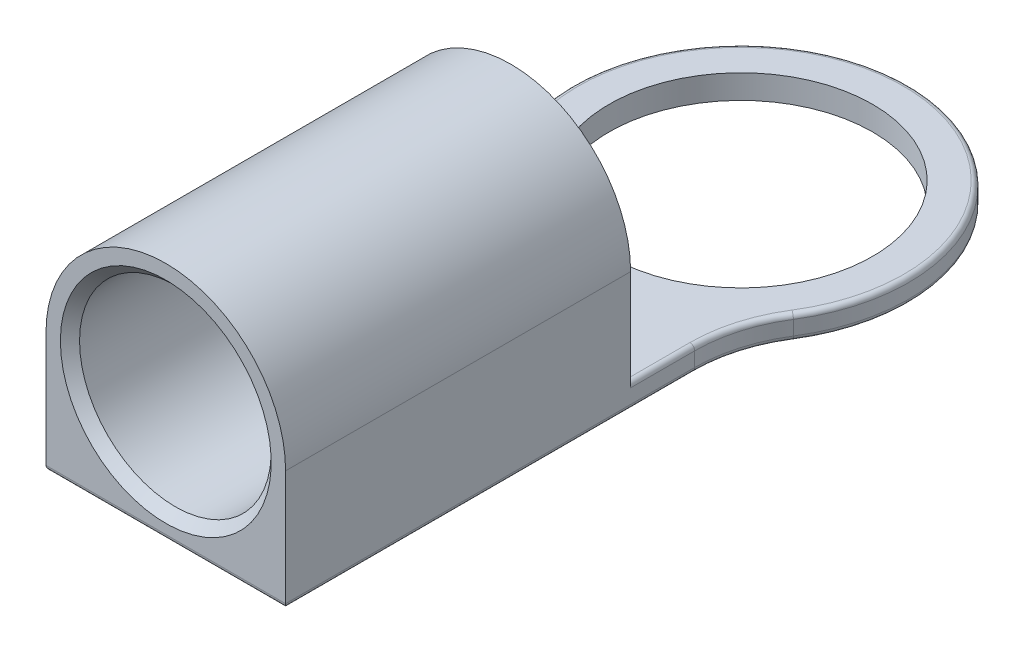
ISO-10303-21;
HEADER;
FILE_DESCRIPTION(('STEP AP214'),'2;1');
FILE_NAME('part.step','',(''),(''),'','','');
FILE_SCHEMA(('AUTOMOTIVE_DESIGN { 1 0 10303 214 1 1 1 1 }'));
ENDSEC;
DATA;
#1=APPLICATION_CONTEXT('core data for automotive mechanical design processes');
#2=APPLICATION_PROTOCOL_DEFINITION('international standard','automotive_design',2000,#1);
#3=PRODUCT_CONTEXT('',#1,'mechanical');
#4=PRODUCT('Part','Part','',(#3));
#5=PRODUCT_RELATED_PRODUCT_CATEGORY('part','',(#4));
#6=PRODUCT_DEFINITION_FORMATION('','',#4);
#7=PRODUCT_DEFINITION_CONTEXT('part definition',#1,'design');
#8=PRODUCT_DEFINITION('design','',#6,#7);
#9=PRODUCT_DEFINITION_SHAPE('','',#8);
#10=(LENGTH_UNIT() NAMED_UNIT(*) SI_UNIT(.MILLI.,.METRE.));
#11=(NAMED_UNIT(*) PLANE_ANGLE_UNIT() SI_UNIT($,.RADIAN.));
#12=(NAMED_UNIT(*) SI_UNIT($,.STERADIAN.) SOLID_ANGLE_UNIT());
#13=UNCERTAINTY_MEASURE_WITH_UNIT(LENGTH_MEASURE(1.E-05),#10,'distance_accuracy_value','');
#14=(GEOMETRIC_REPRESENTATION_CONTEXT(3) GLOBAL_UNCERTAINTY_ASSIGNED_CONTEXT((#13)) GLOBAL_UNIT_ASSIGNED_CONTEXT((#10,
#11,#12)) REPRESENTATION_CONTEXT('',''));
#15=CARTESIAN_POINT('',(0.,0.,0.));
#16=DIRECTION('',(0.,0.,1.));
#17=DIRECTION('',(1.,0.,0.));
#18=AXIS2_PLACEMENT_3D('',#15,#16,#17);
#19=CARTESIAN_POINT('',(0.,2.5,4.8));
#20=DIRECTION('',(0.,0.,1.));
#21=DIRECTION('',(1.,0.,0.));
#22=AXIS2_PLACEMENT_3D('',#19,#20,#21);
#23=CYLINDRICAL_SURFACE('',#22,2.5);
#24=DIRECTION('',(0.,0.,-1.));
#25=VECTOR('',#24,1.);
#26=CARTESIAN_POINT('',(2.5,2.5,4.8));
#27=LINE('',#26,#25);
#28=CARTESIAN_POINT('',(2.5,2.5,4.8));
#29=VERTEX_POINT('',#28);
#30=CARTESIAN_POINT('',(2.5,2.5,12.));
#31=VERTEX_POINT('',#30);
#32=EDGE_CURVE('E164',#29,#31,#27,.F.);
#33=ORIENTED_EDGE('',*,*,#32,.F.);
#34=CARTESIAN_POINT('',(0.,2.5,4.8));
#35=DIRECTION('',(0.,0.,-1.));
#36=DIRECTION('',(-1.,0.,0.));
#37=AXIS2_PLACEMENT_3D('',#34,#35,#36);
#38=CIRCLE('',#37,2.5);
#39=CARTESIAN_POINT('',(-2.5,2.5,4.8));
#40=VERTEX_POINT('',#39);
#41=EDGE_CURVE('E147',#40,#29,#38,.T.);
#42=ORIENTED_EDGE('',*,*,#41,.F.);
#43=DIRECTION('',(0.,0.,-1.));
#44=VECTOR('',#43,1.);
#45=CARTESIAN_POINT('',(-2.5,2.5,4.8));
#46=LINE('',#45,#44);
#47=CARTESIAN_POINT('',(-2.5,2.5,12.));
#48=VERTEX_POINT('',#47);
#49=EDGE_CURVE('E161',#48,#40,#46,.T.);
#50=ORIENTED_EDGE('',*,*,#49,.F.);
#51=CARTESIAN_POINT('',(0.,2.5,12.));
#52=DIRECTION('',(0.,0.,-1.));
#53=DIRECTION('',(-1.,0.,0.));
#54=AXIS2_PLACEMENT_3D('',#51,#52,#53);
#55=CIRCLE('',#54,2.5);
#56=EDGE_CURVE('E160',#31,#48,#55,.F.);
#57=ORIENTED_EDGE('',*,*,#56,.F.);
#58=EDGE_LOOP('',(#33,#42,#50,#57));
#59=FACE_BOUND('',#58,.T.);
#60=ADVANCED_FACE('F35',(#59),#23,.T.);
#61=CARTESIAN_POINT('',(5.5,0.5,3.46410161513775));
#62=DIRECTION('',(0.,-1.,0.));
#63=DIRECTION('',(0.,0.,-1.));
#64=AXIS2_PLACEMENT_3D('',#61,#62,#63);
#65=PLANE('',#64);
#66=CARTESIAN_POINT('',(0.,0.5,0.));
#67=DIRECTION('',(0.,1.,0.));
#68=DIRECTION('',(0.,0.,1.));
#69=AXIS2_PLACEMENT_3D('',#66,#67,#68);
#70=CIRCLE('',#69,2.75);
#71=CARTESIAN_POINT('',(0.,0.5,2.75));
#72=VERTEX_POINT('',#71);
#73=EDGE_CURVE('E183',#72,#72,#70,.T.);
#74=ORIENTED_EDGE('',*,*,#73,.F.);
#75=EDGE_LOOP('',(#74));
#76=FACE_BOUND('',#75,.T.);
#77=CARTESIAN_POINT('',(-5.5,0.5,3.46410161513775));
#78=DIRECTION('',(0.,-1.,0.));
#79=DIRECTION('',(0.,0.,-1.));
#80=AXIS2_PLACEMENT_3D('',#77,#78,#79);
#81=CIRCLE('',#80,3.1);
#82=CARTESIAN_POINT('',(-2.87692307692308,0.5,1.81199161407206));
#83=VERTEX_POINT('',#82);
#84=CARTESIAN_POINT('',(-2.4,0.5,3.46410161513775));
#85=VERTEX_POINT('',#84);
#86=EDGE_CURVE('E212',#83,#85,#81,.T.);
#87=ORIENTED_EDGE('',*,*,#86,.T.);
#88=DIRECTION('',(0.,0.,1.));
#89=VECTOR('',#88,1.);
#90=CARTESIAN_POINT('',(-2.4,0.5,3.46410161513775));
#91=LINE('',#90,#89);
#92=CARTESIAN_POINT('',(-2.4,0.5,4.8));
#93=VERTEX_POINT('',#92);
#94=EDGE_CURVE('E214',#85,#93,#91,.T.);
#95=ORIENTED_EDGE('',*,*,#94,.T.);
#96=DIRECTION('',(1.,0.,0.));
#97=VECTOR('',#96,1.);
#98=CARTESIAN_POINT('',(5.5,0.5,4.8));
#99=LINE('',#98,#97);
#100=CARTESIAN_POINT('',(-0.916515138991179,0.5,4.8));
#101=VERTEX_POINT('',#100);
#102=EDGE_CURVE('E177',#93,#101,#99,.T.);
#103=ORIENTED_EDGE('',*,*,#102,.T.);
#104=CARTESIAN_POINT('',(-0.916515138991179,0.5,4.8));
#105=CARTESIAN_POINT('',(-0.84363513674587,0.5,4.83036711002692));
#106=CARTESIAN_POINT('',(-0.769591679324545,0.5,4.85821712422148));
#107=CARTESIAN_POINT('',(-0.62015560894063,0.5,4.90723485742414));
#108=CARTESIAN_POINT('',(-0.544783603633955,0.5,4.92846598854385));
#109=CARTESIAN_POINT('',(-0.392089728971961,0.5,4.96328235288157));
#110=CARTESIAN_POINT('',(-0.314764837301681,0.5,4.97685486610883));
#111=CARTESIAN_POINT('',(-0.197637077381381,0.5,4.99063916830098));
#112=CARTESIAN_POINT('',(-0.158202916956448,0.5,4.9941389191681));
#113=CARTESIAN_POINT('',(-0.0791826842964666,0.5,4.99882328225748));
#114=CARTESIAN_POINT('',(-0.0395965595447545,0.5,5.00000700500127));
#115=CARTESIAN_POINT('',(0.,0.5,5.));
#116=B_SPLINE_CURVE_WITH_KNOTS('',3,(#104,#105,#106,#107,#108,#109,#110,#111,#112,#113,#114,
#115),.UNSPECIFIED.,.F.,.F.,(4,2,2,2,2,4),(0.,0.236967493249268,0.471589511972893,
0.706600069652834,0.825307034604659,0.944059580428228),.UNSPECIFIED.);
#117=CARTESIAN_POINT('',(0.,0.5,5.));
#118=VERTEX_POINT('',#117);
#119=EDGE_CURVE('E11',#101,#118,#116,.T.);
#120=ORIENTED_EDGE('',*,*,#119,.T.);
#121=CARTESIAN_POINT('',(0.,0.5,5.));
#122=CARTESIAN_POINT('',(0.0613789873451756,0.5,5.00005123546817));
#123=CARTESIAN_POINT('',(0.122727231656672,0.5,4.99717564912901));
#124=CARTESIAN_POINT('',(0.244833267973362,0.5,4.98597228224745));
#125=CARTESIAN_POINT('',(0.305591827191289,0.5,4.97765295134158));
#126=CARTESIAN_POINT('',(0.425380928852015,0.5,4.95610541092143));
#127=CARTESIAN_POINT('',(0.484423705308852,0.5,4.94294391419883));
#128=CARTESIAN_POINT('',(0.601374127472574,0.5,4.91230555854885));
#129=CARTESIAN_POINT('',(0.659281667887905,0.5,4.89482830136551));
#130=CARTESIAN_POINT('',(0.750251888680749,0.5,4.86414653727353));
#131=CARTESIAN_POINT('',(0.783728772482835,0.5,4.85214495966499));
#132=CARTESIAN_POINT('',(0.850382498469053,0.5,4.82693851225511));
#133=CARTESIAN_POINT('',(0.883557571552356,0.5,4.81372895663342));
#134=CARTESIAN_POINT('',(0.916515138991186,0.5,4.80000000000002));
#135=B_SPLINE_CURVE_WITH_KNOTS('',3,(#121,#122,#123,#124,#125,#126,#127,#128,#129,#130,#131,
#132,#133,#134),.UNSPECIFIED.,.F.,.F.,(4,2,2,2,2,2,4),(0.,0.18402076479273,0.367756572804944,
0.549050374316312,0.730360911774295,0.837031638223998,0.944135282226703),.UNSPECIFIED.);
#136=CARTESIAN_POINT('',(0.91651513899118,0.5,4.8));
#137=VERTEX_POINT('',#136);
#138=EDGE_CURVE('E48',#118,#137,#135,.T.);
#139=ORIENTED_EDGE('',*,*,#138,.T.);
#140=CARTESIAN_POINT('',(2.4,0.5,4.8));
#141=VERTEX_POINT('',#140);
#142=EDGE_CURVE('E175',#137,#141,#99,.T.);
#143=ORIENTED_EDGE('',*,*,#142,.T.);
#144=DIRECTION('',(0.,0.,-1.));
#145=VECTOR('',#144,1.);
#146=CARTESIAN_POINT('',(2.4,0.5,3.46410161513775));
#147=LINE('',#146,#145);
#148=CARTESIAN_POINT('',(2.4,0.5,3.46410161513775));
#149=VERTEX_POINT('',#148);
#150=EDGE_CURVE('E206',#141,#149,#147,.T.);
#151=ORIENTED_EDGE('',*,*,#150,.T.);
#152=CARTESIAN_POINT('',(5.5,0.5,3.46410161513775));
#153=DIRECTION('',(0.,-1.,0.));
#154=DIRECTION('',(0.,0.,-1.));
#155=AXIS2_PLACEMENT_3D('',#152,#153,#154);
#156=CIRCLE('',#155,3.1);
#157=CARTESIAN_POINT('',(2.87692307692308,0.5,1.81199161407206));
#158=VERTEX_POINT('',#157);
#159=EDGE_CURVE('E208',#149,#158,#156,.T.);
#160=ORIENTED_EDGE('',*,*,#159,.T.);
#161=CARTESIAN_POINT('',(0.,0.5,0.));
#162=DIRECTION('',(0.,-1.,0.));
#163=DIRECTION('',(0.,0.,-1.));
#164=AXIS2_PLACEMENT_3D('',#161,#162,#163);
#165=CIRCLE('',#164,3.4);
#166=EDGE_CURVE('E210',#158,#83,#165,.F.);
#167=ORIENTED_EDGE('',*,*,#166,.T.);
#168=EDGE_LOOP('',(#87,#95,#103,#120,#139,#143,#151,#160,#167));
#169=FACE_BOUND('',#168,.T.);
#170=ADVANCED_FACE('F296',(#76,#169),#65,.F.);
#171=CARTESIAN_POINT('',(5.5,0.,3.46410161513775));
#172=DIRECTION('',(0.,-1.,0.));
#173=DIRECTION('',(0.,0.,-1.));
#174=AXIS2_PLACEMENT_3D('',#171,#172,#173);
#175=PLANE('',#174);
#176=DIRECTION('',(1.,0.,0.));
#177=VECTOR('',#176,1.);
#178=CARTESIAN_POINT('',(-2.5,0.,11.9));
#179=LINE('',#178,#177);
#180=CARTESIAN_POINT('',(2.4,0.,11.9));
#181=VERTEX_POINT('',#180);
#182=CARTESIAN_POINT('',(-2.4,0.,11.9));
#183=VERTEX_POINT('',#182);
#184=EDGE_CURVE('E236',#181,#183,#179,.F.);
#185=ORIENTED_EDGE('',*,*,#184,.T.);
#186=DIRECTION('',(0.,0.,1.));
#187=VECTOR('',#186,1.);
#188=CARTESIAN_POINT('',(-2.4,0.,3.46410161513775));
#189=LINE('',#188,#187);
#190=CARTESIAN_POINT('',(-2.4,0.,3.46410161513775));
#191=VERTEX_POINT('',#190);
#192=EDGE_CURVE('E244',#183,#191,#189,.F.);
#193=ORIENTED_EDGE('',*,*,#192,.T.);
#194=CARTESIAN_POINT('',(-5.5,0.,3.46410161513775));
#195=DIRECTION('',(0.,-1.,0.));
#196=DIRECTION('',(0.,0.,-1.));
#197=AXIS2_PLACEMENT_3D('',#194,#195,#196);
#198=CIRCLE('',#197,3.1);
#199=CARTESIAN_POINT('',(-2.87692307692308,0.,1.81199161407206));
#200=VERTEX_POINT('',#199);
#201=EDGE_CURVE('E242',#191,#200,#198,.F.);
#202=ORIENTED_EDGE('',*,*,#201,.T.);
#203=CARTESIAN_POINT('',(0.,0.,0.));
#204=DIRECTION('',(0.,-1.,0.));
#205=DIRECTION('',(0.,0.,-1.));
#206=AXIS2_PLACEMENT_3D('',#203,#204,#205);
#207=CIRCLE('',#206,3.4);
#208=CARTESIAN_POINT('',(2.87692307692308,0.,1.81199161407206));
#209=VERTEX_POINT('',#208);
#210=EDGE_CURVE('E240',#200,#209,#207,.T.);
#211=ORIENTED_EDGE('',*,*,#210,.T.);
#212=CARTESIAN_POINT('',(5.5,0.,3.46410161513775));
#213=DIRECTION('',(0.,-1.,0.));
#214=DIRECTION('',(0.,0.,-1.));
#215=AXIS2_PLACEMENT_3D('',#212,#213,#214);
#216=CIRCLE('',#215,3.1);
#217=CARTESIAN_POINT('',(2.4,0.,3.46410161513775));
#218=VERTEX_POINT('',#217);
#219=EDGE_CURVE('E238',#209,#218,#216,.F.);
#220=ORIENTED_EDGE('',*,*,#219,.T.);
#221=DIRECTION('',(0.,0.,-1.));
#222=VECTOR('',#221,1.);
#223=CARTESIAN_POINT('',(2.4,0.,12.));
#224=LINE('',#223,#222);
#225=EDGE_CURVE('E234',#218,#181,#224,.F.);
#226=ORIENTED_EDGE('',*,*,#225,.T.);
#227=EDGE_LOOP('',(#185,#193,#202,#211,#220,#226));
#228=FACE_BOUND('',#227,.T.);
#229=CARTESIAN_POINT('',(0.,0.,0.));
#230=DIRECTION('',(0.,1.,0.));
#231=DIRECTION('',(0.,0.,1.));
#232=AXIS2_PLACEMENT_3D('',#229,#230,#231);
#233=CIRCLE('',#232,2.75);
#234=CARTESIAN_POINT('',(0.,0.,2.75));
#235=VERTEX_POINT('',#234);
#236=EDGE_CURVE('E182',#235,#235,#233,.T.);
#237=ORIENTED_EDGE('',*,*,#236,.T.);
#238=EDGE_LOOP('',(#237));
#239=FACE_BOUND('',#238,.T.);
#240=ADVANCED_FACE('F301',(#228,#239),#175,.T.);
#241=CARTESIAN_POINT('',(5.5,0.5,3.46410161513775));
#242=DIRECTION('',(0.,-1.,0.));
#243=DIRECTION('',(0.,0.,-1.));
#244=AXIS2_PLACEMENT_3D('',#241,#242,#243);
#245=CYLINDRICAL_SURFACE('',#244,3.);
#246=DIRECTION('',(0.,-1.,0.));
#247=VECTOR('',#246,1.);
#248=CARTESIAN_POINT('',(2.96153846153846,0.5,1.86528548507417));
#249=LINE('',#248,#247);
#250=CARTESIAN_POINT('',(2.96153846153846,0.4,1.86528548507417));
#251=VERTEX_POINT('',#250);
#252=CARTESIAN_POINT('',(2.96153846153846,0.1,1.86528548507417));
#253=VERTEX_POINT('',#252);
#254=EDGE_CURVE('E168',#251,#253,#249,.T.);
#255=ORIENTED_EDGE('',*,*,#254,.F.);
#256=CARTESIAN_POINT('',(5.5,0.4,3.46410161513775));
#257=DIRECTION('',(0.,-1.,0.));
#258=DIRECTION('',(0.,0.,-1.));
#259=AXIS2_PLACEMENT_3D('',#256,#257,#258);
#260=CIRCLE('',#259,3.);
#261=CARTESIAN_POINT('',(2.5,0.4,3.46410161513775));
#262=VERTEX_POINT('',#261);
#263=EDGE_CURVE('E232',#251,#262,#260,.F.);
#264=ORIENTED_EDGE('',*,*,#263,.T.);
#265=DIRECTION('',(0.,-1.,0.));
#266=VECTOR('',#265,1.);
#267=CARTESIAN_POINT('',(2.5,0.5,3.46410161513775));
#268=LINE('',#267,#266);
#269=CARTESIAN_POINT('',(2.5,0.1,3.46410161513775));
#270=VERTEX_POINT('',#269);
#271=EDGE_CURVE('E186',#262,#270,#268,.T.);
#272=ORIENTED_EDGE('',*,*,#271,.T.);
#273=CARTESIAN_POINT('',(5.5,0.1,3.46410161513775));
#274=DIRECTION('',(0.,-1.,0.));
#275=DIRECTION('',(0.,0.,-1.));
#276=AXIS2_PLACEMENT_3D('',#273,#274,#275);
#277=CIRCLE('',#276,3.);
#278=EDGE_CURVE('E230',#270,#253,#277,.T.);
#279=ORIENTED_EDGE('',*,*,#278,.T.);
#280=EDGE_LOOP('',(#255,#264,#272,#279));
#281=FACE_BOUND('',#280,.T.);
#282=ADVANCED_FACE('F308',(#281),#245,.F.);
#283=CARTESIAN_POINT('',(0.,0.5,0.));
#284=DIRECTION('',(0.,-1.,0.));
#285=DIRECTION('',(0.,0.,-1.));
#286=AXIS2_PLACEMENT_3D('',#283,#284,#285);
#287=CYLINDRICAL_SURFACE('',#286,3.5);
#288=DIRECTION('',(0.,-1.,0.));
#289=VECTOR('',#288,1.);
#290=CARTESIAN_POINT('',(-2.96153846153846,0.5,1.86528548507418));
#291=LINE('',#290,#289);
#292=CARTESIAN_POINT('',(-2.96153846153846,0.4,1.86528548507418));
#293=VERTEX_POINT('',#292);
#294=CARTESIAN_POINT('',(-2.96153846153846,0.1,1.86528548507418));
#295=VERTEX_POINT('',#294);
#296=EDGE_CURVE('E199',#293,#295,#291,.T.);
#297=ORIENTED_EDGE('',*,*,#296,.F.);
#298=CARTESIAN_POINT('',(0.,0.4,0.));
#299=DIRECTION('',(0.,-1.,0.));
#300=DIRECTION('',(0.,0.,-1.));
#301=AXIS2_PLACEMENT_3D('',#298,#299,#300);
#302=CIRCLE('',#301,3.5);
#303=EDGE_CURVE('E228',#293,#251,#302,.T.);
#304=ORIENTED_EDGE('',*,*,#303,.T.);
#305=ORIENTED_EDGE('',*,*,#254,.T.);
#306=CARTESIAN_POINT('',(0.,0.1,0.));
#307=DIRECTION('',(0.,-1.,0.));
#308=DIRECTION('',(0.,0.,-1.));
#309=AXIS2_PLACEMENT_3D('',#306,#307,#308);
#310=CIRCLE('',#309,3.5);
#311=EDGE_CURVE('E226',#253,#295,#310,.F.);
#312=ORIENTED_EDGE('',*,*,#311,.T.);
#313=EDGE_LOOP('',(#297,#304,#305,#312));
#314=FACE_BOUND('',#313,.T.);
#315=ADVANCED_FACE('F323',(#314),#287,.T.);
#316=CARTESIAN_POINT('',(-5.5,0.5,3.46410161513775));
#317=DIRECTION('',(0.,-1.,0.));
#318=DIRECTION('',(0.,0.,-1.));
#319=AXIS2_PLACEMENT_3D('',#316,#317,#318);
#320=CYLINDRICAL_SURFACE('',#319,3.);
#321=DIRECTION('',(0.,-1.,0.));
#322=VECTOR('',#321,1.);
#323=CARTESIAN_POINT('',(-2.5,0.5,3.46410161513775));
#324=LINE('',#323,#322);
#325=CARTESIAN_POINT('',(-2.5,0.4,3.46410161513775));
#326=VERTEX_POINT('',#325);
#327=CARTESIAN_POINT('',(-2.5,0.1,3.46410161513775));
#328=VERTEX_POINT('',#327);
#329=EDGE_CURVE('E196',#326,#328,#324,.T.);
#330=ORIENTED_EDGE('',*,*,#329,.F.);
#331=CARTESIAN_POINT('',(-5.5,0.4,3.46410161513775));
#332=DIRECTION('',(0.,-1.,0.));
#333=DIRECTION('',(0.,0.,-1.));
#334=AXIS2_PLACEMENT_3D('',#331,#332,#333);
#335=CIRCLE('',#334,3.);
#336=EDGE_CURVE('E224',#326,#293,#335,.F.);
#337=ORIENTED_EDGE('',*,*,#336,.T.);
#338=ORIENTED_EDGE('',*,*,#296,.T.);
#339=CARTESIAN_POINT('',(-5.5,0.1,3.46410161513775));
#340=DIRECTION('',(0.,-1.,0.));
#341=DIRECTION('',(0.,0.,-1.));
#342=AXIS2_PLACEMENT_3D('',#339,#340,#341);
#343=CIRCLE('',#342,3.);
#344=EDGE_CURVE('E222',#295,#328,#343,.T.);
#345=ORIENTED_EDGE('',*,*,#344,.T.);
#346=EDGE_LOOP('',(#330,#337,#338,#345));
#347=FACE_BOUND('',#346,.T.);
#348=ADVANCED_FACE('F319',(#347),#320,.F.);
#349=CARTESIAN_POINT('',(-2.5,0.5,3.46410161513775));
#350=DIRECTION('',(1.,0.,0.));
#351=DIRECTION('',(0.,0.,-1.));
#352=AXIS2_PLACEMENT_3D('',#349,#350,#351);
#353=PLANE('',#352);
#354=DIRECTION('',(0.,-1.,0.));
#355=VECTOR('',#354,1.);
#356=CARTESIAN_POINT('',(-2.5,0.,4.8));
#357=LINE('',#356,#355);
#358=CARTESIAN_POINT('',(-2.5,0.4,4.8));
#359=VERTEX_POINT('',#358);
#360=EDGE_CURVE('E156',#40,#359,#357,.T.);
#361=ORIENTED_EDGE('',*,*,#360,.T.);
#362=DIRECTION('',(0.,0.,1.));
#363=VECTOR('',#362,1.);
#364=CARTESIAN_POINT('',(-2.5,0.4,3.46410161513775));
#365=LINE('',#364,#363);
#366=EDGE_CURVE('E220',#359,#326,#365,.F.);
#367=ORIENTED_EDGE('',*,*,#366,.T.);
#368=ORIENTED_EDGE('',*,*,#329,.T.);
#369=DIRECTION('',(0.,0.,1.));
#370=VECTOR('',#369,1.);
#371=CARTESIAN_POINT('',(-2.5,0.1,12.));
#372=LINE('',#371,#370);
#373=CARTESIAN_POINT('',(-2.5,0.1,12.));
#374=VERTEX_POINT('',#373);
#375=EDGE_CURVE('E217',#328,#374,#372,.T.);
#376=ORIENTED_EDGE('',*,*,#375,.T.);
#377=DIRECTION('',(0.,-1.,0.));
#378=VECTOR('',#377,1.);
#379=CARTESIAN_POINT('',(-2.5,0.5,12.));
#380=LINE('',#379,#378);
#381=EDGE_CURVE('E193',#48,#374,#380,.T.);
#382=ORIENTED_EDGE('',*,*,#381,.F.);
#383=ORIENTED_EDGE('',*,*,#49,.T.);
#384=EDGE_LOOP('',(#361,#367,#368,#376,#382,#383));
#385=FACE_BOUND('',#384,.T.);
#386=ADVANCED_FACE('F315',(#385),#353,.F.);
#387=CARTESIAN_POINT('',(-2.5,0.5,12.));
#388=DIRECTION('',(0.,0.,-1.));
#389=DIRECTION('',(-1.,0.,0.));
#390=AXIS2_PLACEMENT_3D('',#387,#388,#389);
#391=PLANE('',#390);
#392=CARTESIAN_POINT('',(0.,2.5,12.));
#393=DIRECTION('',(0.,0.,-1.));
#394=DIRECTION('',(-1.,0.,0.));
#395=AXIS2_PLACEMENT_3D('',#392,#393,#394);
#396=CIRCLE('',#395,2.2);
#397=CARTESIAN_POINT('',(-2.2,2.5,12.));
#398=VERTEX_POINT('',#397);
#399=EDGE_CURVE('E289',#398,#398,#396,.T.);
#400=ORIENTED_EDGE('',*,*,#399,.T.);
#401=EDGE_LOOP('',(#400));
#402=FACE_BOUND('',#401,.T.);
#403=ORIENTED_EDGE('',*,*,#381,.T.);
#404=DIRECTION('',(1.,0.,0.));
#405=VECTOR('',#404,1.);
#406=CARTESIAN_POINT('',(2.5,0.1,12.));
#407=LINE('',#406,#405);
#408=CARTESIAN_POINT('',(2.5,0.1,12.));
#409=VERTEX_POINT('',#408);
#410=EDGE_CURVE('E250',#374,#409,#407,.T.);
#411=ORIENTED_EDGE('',*,*,#410,.T.);
#412=DIRECTION('',(0.,-1.,0.));
#413=VECTOR('',#412,1.);
#414=CARTESIAN_POINT('',(2.5,0.5,12.));
#415=LINE('',#414,#413);
#416=EDGE_CURVE('E191',#31,#409,#415,.T.);
#417=ORIENTED_EDGE('',*,*,#416,.F.);
#418=ORIENTED_EDGE('',*,*,#56,.T.);
#419=EDGE_LOOP('',(#403,#411,#417,#418));
#420=FACE_BOUND('',#419,.T.);
#421=ADVANCED_FACE('F312',(#402,#420),#391,.F.);
#422=CARTESIAN_POINT('',(2.5,0.5,12.));
#423=DIRECTION('',(-1.,0.,0.));
#424=DIRECTION('',(0.,0.,1.));
#425=AXIS2_PLACEMENT_3D('',#422,#423,#424);
#426=PLANE('',#425);
#427=ORIENTED_EDGE('',*,*,#271,.F.);
#428=DIRECTION('',(0.,0.,-1.));
#429=VECTOR('',#428,1.);
#430=CARTESIAN_POINT('',(2.5,0.4,12.));
#431=LINE('',#430,#429);
#432=CARTESIAN_POINT('',(2.5,0.4,4.8));
#433=VERTEX_POINT('',#432);
#434=EDGE_CURVE('E173',#262,#433,#431,.F.);
#435=ORIENTED_EDGE('',*,*,#434,.T.);
#436=DIRECTION('',(0.,1.,0.));
#437=VECTOR('',#436,1.);
#438=CARTESIAN_POINT('',(2.5,0.,4.8));
#439=LINE('',#438,#437);
#440=EDGE_CURVE('E153',#433,#29,#439,.T.);
#441=ORIENTED_EDGE('',*,*,#440,.T.);
#442=ORIENTED_EDGE('',*,*,#32,.T.);
#443=ORIENTED_EDGE('',*,*,#416,.T.);
#444=DIRECTION('',(0.,0.,-1.));
#445=VECTOR('',#444,1.);
#446=CARTESIAN_POINT('',(2.5,0.1,3.46410161513775));
#447=LINE('',#446,#445);
#448=EDGE_CURVE('E247',#409,#270,#447,.T.);
#449=ORIENTED_EDGE('',*,*,#448,.T.);
#450=EDGE_LOOP('',(#427,#435,#441,#442,#443,#449));
#451=FACE_BOUND('',#450,.T.);
#452=ADVANCED_FACE('F171',(#451),#426,.F.);
#453=CARTESIAN_POINT('',(0.,0.5,0.));
#454=DIRECTION('',(0.,-1.,0.));
#455=DIRECTION('',(0.,0.,-1.));
#456=AXIS2_PLACEMENT_3D('',#453,#454,#455);
#457=CYLINDRICAL_SURFACE('',#456,2.75);
#458=ORIENTED_EDGE('',*,*,#73,.T.);
#459=EDGE_LOOP('',(#458));
#460=FACE_BOUND('',#459,.T.);
#461=ORIENTED_EDGE('',*,*,#236,.F.);
#462=EDGE_LOOP('',(#461));
#463=FACE_BOUND('',#462,.T.);
#464=ADVANCED_FACE('F303',(#460,#463),#457,.F.);
#465=CARTESIAN_POINT('',(0.,0.,4.8));
#466=DIRECTION('',(0.,0.,-1.));
#467=DIRECTION('',(-1.,0.,0.));
#468=AXIS2_PLACEMENT_3D('',#465,#466,#467);
#469=PLANE('',#468);
#470=ORIENTED_EDGE('',*,*,#142,.F.);
#471=CARTESIAN_POINT('',(0.,2.5,4.8));
#472=DIRECTION('',(0.,0.,-1.));
#473=DIRECTION('',(-1.,0.,0.));
#474=AXIS2_PLACEMENT_3D('',#471,#472,#473);
#475=CIRCLE('',#474,2.2);
#476=EDGE_CURVE('E292',#137,#101,#475,.F.);
#477=ORIENTED_EDGE('',*,*,#476,.T.);
#478=ORIENTED_EDGE('',*,*,#102,.F.);
#479=CARTESIAN_POINT('',(-2.4,0.4,4.8));
#480=DIRECTION('',(0.,0.,-1.));
#481=DIRECTION('',(-1.,0.,0.));
#482=AXIS2_PLACEMENT_3D('',#479,#480,#481);
#483=CIRCLE('',#482,0.1);
#484=EDGE_CURVE('E252',#93,#359,#483,.F.);
#485=ORIENTED_EDGE('',*,*,#484,.T.);
#486=ORIENTED_EDGE('',*,*,#360,.F.);
#487=ORIENTED_EDGE('',*,*,#41,.T.);
#488=ORIENTED_EDGE('',*,*,#440,.F.);
#489=CARTESIAN_POINT('',(2.4,0.4,4.8));
#490=DIRECTION('',(0.,0.,-1.));
#491=DIRECTION('',(-1.,0.,0.));
#492=AXIS2_PLACEMENT_3D('',#489,#490,#491);
#493=CIRCLE('',#492,0.1);
#494=EDGE_CURVE('E254',#433,#141,#493,.F.);
#495=ORIENTED_EDGE('',*,*,#494,.T.);
#496=EDGE_LOOP('',(#470,#477,#478,#485,#486,#487,#488,#495));
#497=FACE_BOUND('',#496,.T.);
#498=ADVANCED_FACE('F150',(#497),#469,.T.);
#499=CARTESIAN_POINT('',(0.,2.5,-3.5));
#500=DIRECTION('',(0.,0.,1.));
#501=DIRECTION('',(1.,0.,0.));
#502=AXIS2_PLACEMENT_3D('',#499,#500,#501);
#503=CYLINDRICAL_SURFACE('',#502,2.);
#504=CARTESIAN_POINT('',(0.,2.5,11.8));
#505=DIRECTION('',(0.,0.,-1.));
#506=DIRECTION('',(-1.,0.,0.));
#507=AXIS2_PLACEMENT_3D('',#504,#505,#506);
#508=CIRCLE('',#507,2.);
#509=CARTESIAN_POINT('',(-2.,2.5,11.8));
#510=VERTEX_POINT('',#509);
#511=EDGE_CURVE('E286',#510,#510,#508,.F.);
#512=ORIENTED_EDGE('',*,*,#511,.T.);
#513=EDGE_LOOP('',(#512));
#514=FACE_BOUND('',#513,.T.);
#515=CARTESIAN_POINT('',(0.,2.5,5.));
#516=DIRECTION('',(0.,0.,-1.));
#517=DIRECTION('',(-1.,0.,0.));
#518=AXIS2_PLACEMENT_3D('',#515,#516,#517);
#519=CIRCLE('',#518,2.);
#520=EDGE_CURVE('E256',#118,#118,#519,.T.);
#521=ORIENTED_EDGE('',*,*,#520,.T.);
#522=EDGE_LOOP('',(#521));
#523=FACE_BOUND('',#522,.T.);
#524=ADVANCED_FACE('F353',(#514,#523),#503,.F.);
#525=CARTESIAN_POINT('',(2.4,0.4,3.46410161513775));
#526=DIRECTION('',(0.,0.,-1.));
#527=DIRECTION('',(-1.,0.,0.));
#528=AXIS2_PLACEMENT_3D('',#525,#526,#527);
#529=CYLINDRICAL_SURFACE('',#528,0.1);
#530=ORIENTED_EDGE('',*,*,#494,.F.);
#531=ORIENTED_EDGE('',*,*,#434,.F.);
#532=CARTESIAN_POINT('',(2.4,0.4,3.46410161513775));
#533=DIRECTION('',(0.,0.,-1.));
#534=DIRECTION('',(-1.,0.,0.));
#535=AXIS2_PLACEMENT_3D('',#532,#533,#534);
#536=CIRCLE('',#535,0.1);
#537=EDGE_CURVE('E179',#149,#262,#536,.T.);
#538=ORIENTED_EDGE('',*,*,#537,.F.);
#539=ORIENTED_EDGE('',*,*,#150,.F.);
#540=EDGE_LOOP('',(#530,#531,#538,#539));
#541=FACE_BOUND('',#540,.T.);
#542=ADVANCED_FACE('F349',(#541),#529,.T.);
#543=CARTESIAN_POINT('',(5.5,0.4,3.46410161513775));
#544=DIRECTION('',(0.,-1.,0.));
#545=DIRECTION('',(0.,0.,-1.));
#546=AXIS2_PLACEMENT_3D('',#543,#544,#545);
#547=TOROIDAL_SURFACE('',#546,3.1,0.1);
#548=ORIENTED_EDGE('',*,*,#537,.T.);
#549=ORIENTED_EDGE('',*,*,#263,.F.);
#550=CARTESIAN_POINT('',(2.87692307692308,0.4,1.81199161407206));
#551=DIRECTION('',(0.532938710021192,0.,-0.846153846153847));
#552=DIRECTION('',(-0.846153846153847,0.,-0.532938710021192));
#553=AXIS2_PLACEMENT_3D('',#550,#551,#552);
#554=CIRCLE('',#553,0.1);
#555=EDGE_CURVE('E264',#158,#251,#554,.T.);
#556=ORIENTED_EDGE('',*,*,#555,.F.);
#557=ORIENTED_EDGE('',*,*,#159,.F.);
#558=EDGE_LOOP('',(#548,#549,#556,#557));
#559=FACE_BOUND('',#558,.T.);
#560=ADVANCED_FACE('F345',(#559),#547,.T.);
#561=CARTESIAN_POINT('',(0.,0.4,0.));
#562=DIRECTION('',(0.,-1.,0.));
#563=DIRECTION('',(0.,0.,-1.));
#564=AXIS2_PLACEMENT_3D('',#561,#562,#563);
#565=TOROIDAL_SURFACE('',#564,3.4,0.1);
#566=ORIENTED_EDGE('',*,*,#555,.T.);
#567=ORIENTED_EDGE('',*,*,#303,.F.);
#568=CARTESIAN_POINT('',(-2.87692307692308,0.4,1.81199161407206));
#569=DIRECTION('',(0.532938710021192,0.,0.846153846153847));
#570=DIRECTION('',(0.846153846153847,0.,-0.532938710021192));
#571=AXIS2_PLACEMENT_3D('',#568,#569,#570);
#572=CIRCLE('',#571,0.1);
#573=EDGE_CURVE('E260',#83,#293,#572,.T.);
#574=ORIENTED_EDGE('',*,*,#573,.F.);
#575=ORIENTED_EDGE('',*,*,#166,.F.);
#576=EDGE_LOOP('',(#566,#567,#574,#575));
#577=FACE_BOUND('',#576,.T.);
#578=ADVANCED_FACE('F341',(#577),#565,.T.);
#579=CARTESIAN_POINT('',(-5.5,0.4,3.46410161513775));
#580=DIRECTION('',(0.,-1.,0.));
#581=DIRECTION('',(0.,0.,-1.));
#582=AXIS2_PLACEMENT_3D('',#579,#580,#581);
#583=TOROIDAL_SURFACE('',#582,3.1,0.1);
#584=ORIENTED_EDGE('',*,*,#573,.T.);
#585=ORIENTED_EDGE('',*,*,#336,.F.);
#586=CARTESIAN_POINT('',(-2.4,0.4,3.46410161513775));
#587=DIRECTION('',(0.,0.,1.));
#588=DIRECTION('',(1.,0.,0.));
#589=AXIS2_PLACEMENT_3D('',#586,#587,#588);
#590=CIRCLE('',#589,0.1);
#591=EDGE_CURVE('E257',#85,#326,#590,.T.);
#592=ORIENTED_EDGE('',*,*,#591,.F.);
#593=ORIENTED_EDGE('',*,*,#86,.F.);
#594=EDGE_LOOP('',(#584,#585,#592,#593));
#595=FACE_BOUND('',#594,.T.);
#596=ADVANCED_FACE('F337',(#595),#583,.T.);
#597=CARTESIAN_POINT('',(-2.4,0.4,3.46410161513775));
#598=DIRECTION('',(0.,0.,1.));
#599=DIRECTION('',(1.,0.,0.));
#600=AXIS2_PLACEMENT_3D('',#597,#598,#599);
#601=CYLINDRICAL_SURFACE('',#600,0.1);
#602=ORIENTED_EDGE('',*,*,#591,.T.);
#603=ORIENTED_EDGE('',*,*,#366,.F.);
#604=ORIENTED_EDGE('',*,*,#484,.F.);
#605=ORIENTED_EDGE('',*,*,#94,.F.);
#606=EDGE_LOOP('',(#602,#603,#604,#605));
#607=FACE_BOUND('',#606,.T.);
#608=ADVANCED_FACE('F333',(#607),#601,.T.);
#609=CARTESIAN_POINT('',(5.5,0.1,3.46410161513775));
#610=DIRECTION('',(0.,-1.,0.));
#611=DIRECTION('',(0.,0.,-1.));
#612=AXIS2_PLACEMENT_3D('',#609,#610,#611);
#613=TOROIDAL_SURFACE('',#612,3.1,0.1);
#614=CARTESIAN_POINT('',(2.4,0.1,3.46410161513775));
#615=DIRECTION('',(0.,0.,1.));
#616=DIRECTION('',(1.,0.,0.));
#617=AXIS2_PLACEMENT_3D('',#614,#615,#616);
#618=CIRCLE('',#617,0.1);
#619=EDGE_CURVE('E279',#218,#270,#618,.T.);
#620=ORIENTED_EDGE('',*,*,#619,.F.);
#621=ORIENTED_EDGE('',*,*,#219,.F.);
#622=CARTESIAN_POINT('',(2.87692307692308,0.1,1.81199161407206));
#623=DIRECTION('',(0.532938710021192,0.,-0.846153846153847));
#624=DIRECTION('',(-0.846153846153847,0.,-0.532938710021192));
#625=AXIS2_PLACEMENT_3D('',#622,#623,#624);
#626=CIRCLE('',#625,0.1);
#627=EDGE_CURVE('E261',#253,#209,#626,.T.);
#628=ORIENTED_EDGE('',*,*,#627,.F.);
#629=ORIENTED_EDGE('',*,*,#278,.F.);
#630=EDGE_LOOP('',(#620,#621,#628,#629));
#631=FACE_BOUND('',#630,.T.);
#632=ADVANCED_FACE('F336',(#631),#613,.T.);
#633=CARTESIAN_POINT('',(0.,0.1,0.));
#634=DIRECTION('',(0.,-1.,0.));
#635=DIRECTION('',(0.,0.,-1.));
#636=AXIS2_PLACEMENT_3D('',#633,#634,#635);
#637=TOROIDAL_SURFACE('',#636,3.4,0.1);
#638=ORIENTED_EDGE('',*,*,#627,.T.);
#639=ORIENTED_EDGE('',*,*,#210,.F.);
#640=CARTESIAN_POINT('',(-2.87692307692308,0.1,1.81199161407206));
#641=DIRECTION('',(0.532938710021192,0.,0.846153846153847));
#642=DIRECTION('',(0.846153846153847,0.,-0.532938710021192));
#643=AXIS2_PLACEMENT_3D('',#640,#641,#642);
#644=CIRCLE('',#643,0.1);
#645=EDGE_CURVE('E276',#295,#200,#644,.T.);
#646=ORIENTED_EDGE('',*,*,#645,.F.);
#647=ORIENTED_EDGE('',*,*,#311,.F.);
#648=EDGE_LOOP('',(#638,#639,#646,#647));
#649=FACE_BOUND('',#648,.T.);
#650=ADVANCED_FACE('F371',(#649),#637,.T.);
#651=CARTESIAN_POINT('',(2.4,0.1,12.));
#652=DIRECTION('',(0.,0.,1.));
#653=DIRECTION('',(1.,0.,0.));
#654=AXIS2_PLACEMENT_3D('',#651,#652,#653);
#655=CYLINDRICAL_SURFACE('',#654,0.1);
#656=ORIENTED_EDGE('',*,*,#619,.T.);
#657=ORIENTED_EDGE('',*,*,#448,.F.);
#658=CARTESIAN_POINT('',(2.4,0.1,11.9));
#659=DIRECTION('',(-0.707106781186547,0.,0.707106781186548));
#660=DIRECTION('',(0.707106781186547,0.,0.707106781186547));
#661=AXIS2_PLACEMENT_3D('',#658,#659,#660);
#662=ELLIPSE('',#661,0.14142135623731,0.1);
#663=EDGE_CURVE('E273',#181,#409,#662,.T.);
#664=ORIENTED_EDGE('',*,*,#663,.F.);
#665=ORIENTED_EDGE('',*,*,#225,.F.);
#666=EDGE_LOOP('',(#656,#657,#664,#665));
#667=FACE_BOUND('',#666,.T.);
#668=ADVANCED_FACE('F367',(#667),#655,.T.);
#669=CARTESIAN_POINT('',(-5.5,0.1,3.46410161513775));
#670=DIRECTION('',(0.,-1.,0.));
#671=DIRECTION('',(0.,0.,-1.));
#672=AXIS2_PLACEMENT_3D('',#669,#670,#671);
#673=TOROIDAL_SURFACE('',#672,3.1,0.1);
#674=ORIENTED_EDGE('',*,*,#645,.T.);
#675=ORIENTED_EDGE('',*,*,#201,.F.);
#676=CARTESIAN_POINT('',(-2.4,0.1,3.46410161513775));
#677=DIRECTION('',(0.,0.,1.));
#678=DIRECTION('',(1.,0.,0.));
#679=AXIS2_PLACEMENT_3D('',#676,#677,#678);
#680=CIRCLE('',#679,0.1);
#681=EDGE_CURVE('E271',#328,#191,#680,.T.);
#682=ORIENTED_EDGE('',*,*,#681,.F.);
#683=ORIENTED_EDGE('',*,*,#344,.F.);
#684=EDGE_LOOP('',(#674,#675,#682,#683));
#685=FACE_BOUND('',#684,.T.);
#686=ADVANCED_FACE('F363',(#685),#673,.T.);
#687=CARTESIAN_POINT('',(-2.5,0.1,11.9));
#688=DIRECTION('',(-1.,0.,0.));
#689=DIRECTION('',(0.,0.,1.));
#690=AXIS2_PLACEMENT_3D('',#687,#688,#689);
#691=CYLINDRICAL_SURFACE('',#690,0.1);
#692=ORIENTED_EDGE('',*,*,#663,.T.);
#693=ORIENTED_EDGE('',*,*,#410,.F.);
#694=CARTESIAN_POINT('',(-2.4,0.1,11.9));
#695=DIRECTION('',(-0.707106781186547,0.,-0.707106781186547));
#696=DIRECTION('',(-0.707106781186547,0.,0.707106781186548));
#697=AXIS2_PLACEMENT_3D('',#694,#695,#696);
#698=ELLIPSE('',#697,0.14142135623731,0.1);
#699=EDGE_CURVE('E269',#183,#374,#698,.T.);
#700=ORIENTED_EDGE('',*,*,#699,.F.);
#701=ORIENTED_EDGE('',*,*,#184,.F.);
#702=EDGE_LOOP('',(#692,#693,#700,#701));
#703=FACE_BOUND('',#702,.T.);
#704=ADVANCED_FACE('F359',(#703),#691,.T.);
#705=CARTESIAN_POINT('',(-2.4,0.1,3.46410161513775));
#706=DIRECTION('',(0.,0.,-1.));
#707=DIRECTION('',(-1.,0.,0.));
#708=AXIS2_PLACEMENT_3D('',#705,#706,#707);
#709=CYLINDRICAL_SURFACE('',#708,0.1);
#710=ORIENTED_EDGE('',*,*,#681,.T.);
#711=ORIENTED_EDGE('',*,*,#192,.F.);
#712=ORIENTED_EDGE('',*,*,#699,.T.);
#713=ORIENTED_EDGE('',*,*,#375,.F.);
#714=EDGE_LOOP('',(#710,#711,#712,#713));
#715=FACE_BOUND('',#714,.T.);
#716=ADVANCED_FACE('F355',(#715),#709,.T.);
#717=CARTESIAN_POINT('',(0.,2.5,11.8));
#718=DIRECTION('',(0.,0.,1.));
#719=DIRECTION('',(1.,0.,0.));
#720=AXIS2_PLACEMENT_3D('',#717,#718,#719);
#721=CONICAL_SURFACE('',#720,2.,0.785398163397448);
#722=ORIENTED_EDGE('',*,*,#399,.F.);
#723=EDGE_LOOP('',(#722));
#724=FACE_BOUND('',#723,.T.);
#725=ORIENTED_EDGE('',*,*,#511,.F.);
#726=EDGE_LOOP('',(#725));
#727=FACE_BOUND('',#726,.T.);
#728=ADVANCED_FACE('F358',(#724,#727),#721,.F.);
#729=CARTESIAN_POINT('',(0.,2.5,5.));
#730=DIRECTION('',(0.,0.,-1.));
#731=DIRECTION('',(-1.,0.,0.));
#732=AXIS2_PLACEMENT_3D('',#729,#730,#731);
#733=CONICAL_SURFACE('',#732,2.,0.785398163397453);
#734=ORIENTED_EDGE('',*,*,#119,.F.);
#735=ORIENTED_EDGE('',*,*,#476,.F.);
#736=ORIENTED_EDGE('',*,*,#138,.F.);
#737=ORIENTED_EDGE('',*,*,#520,.F.);
#738=EDGE_LOOP('',(#734,#735,#736,#737));
#739=FACE_BOUND('',#738,.T.);
#740=ADVANCED_FACE('F37',(#739),#733,.F.);
#741=CLOSED_SHELL('',(#60,#170,#240,#282,#315,#348,#386,#421,#452,#464,#498,#524,#542,#560,#578,
#596,#608,#632,#650,#668,#686,#704,#716,#728,#740));
#742=MANIFOLD_SOLID_BREP('B2',#741);
#743=ADVANCED_BREP_SHAPE_REPRESENTATION('',(#18,#742),#14);
#744=SHAPE_DEFINITION_REPRESENTATION(#9,#743);
ENDSEC;
END-ISO-10303-21;
